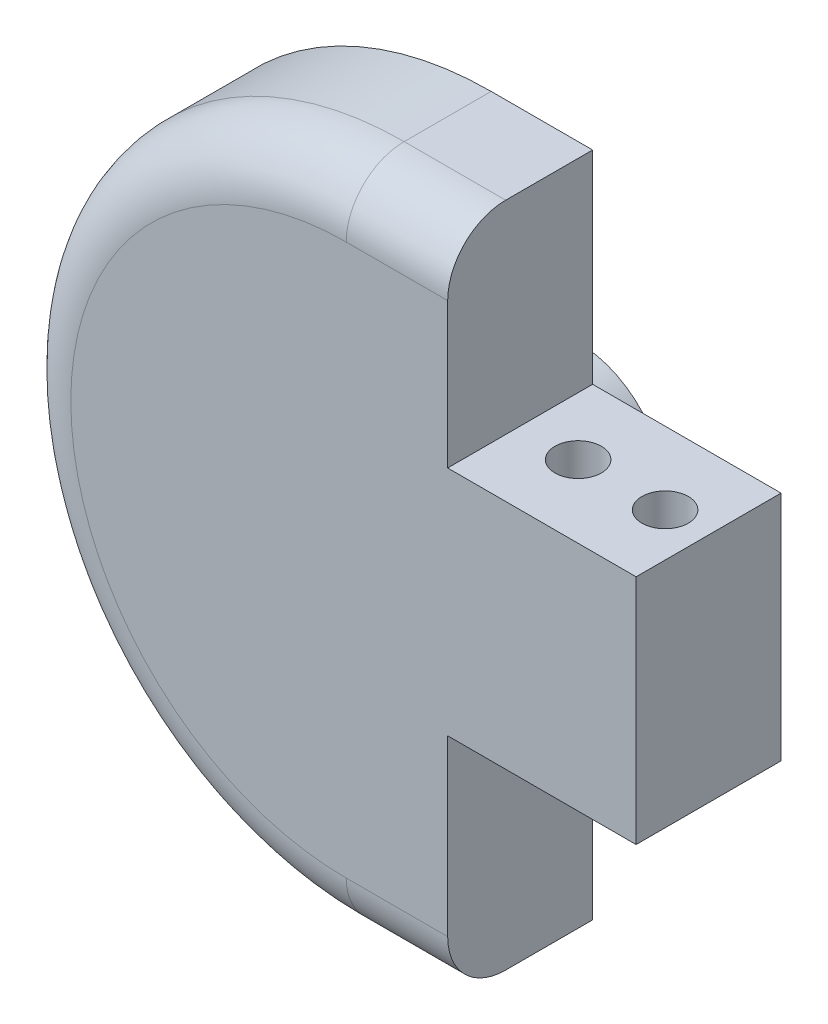
ISO-10303-21;
HEADER;
FILE_DESCRIPTION(('STEP AP214'),'2;1');
FILE_NAME('part.step','',(''),(''),'','','');
FILE_SCHEMA(('AUTOMOTIVE_DESIGN { 1 0 10303 214 1 1 1 1 }'));
ENDSEC;
DATA;
#1=APPLICATION_CONTEXT('core data for automotive mechanical design processes');
#2=APPLICATION_PROTOCOL_DEFINITION('international standard','automotive_design',2000,#1);
#3=PRODUCT_CONTEXT('',#1,'mechanical');
#4=PRODUCT('Part','Part','',(#3));
#5=PRODUCT_RELATED_PRODUCT_CATEGORY('part','',(#4));
#6=PRODUCT_DEFINITION_FORMATION('','',#4);
#7=PRODUCT_DEFINITION_CONTEXT('part definition',#1,'design');
#8=PRODUCT_DEFINITION('design','',#6,#7);
#9=PRODUCT_DEFINITION_SHAPE('','',#8);
#10=(LENGTH_UNIT() NAMED_UNIT(*) SI_UNIT(.MILLI.,.METRE.));
#11=(NAMED_UNIT(*) PLANE_ANGLE_UNIT() SI_UNIT($,.RADIAN.));
#12=(NAMED_UNIT(*) SI_UNIT($,.STERADIAN.) SOLID_ANGLE_UNIT());
#13=UNCERTAINTY_MEASURE_WITH_UNIT(LENGTH_MEASURE(1.E-05),#10,'distance_accuracy_value','');
#14=(GEOMETRIC_REPRESENTATION_CONTEXT(3) GLOBAL_UNCERTAINTY_ASSIGNED_CONTEXT((#13)) GLOBAL_UNIT_ASSIGNED_CONTEXT((#10,
#11,#12)) REPRESENTATION_CONTEXT('',''));
#15=CARTESIAN_POINT('',(0.,0.,0.));
#16=DIRECTION('',(0.,0.,1.));
#17=DIRECTION('',(1.,0.,0.));
#18=AXIS2_PLACEMENT_3D('',#15,#16,#17);
#19=CARTESIAN_POINT('',(0.,0.5,5.));
#20=DIRECTION('',(0.,0.,-1.));
#21=DIRECTION('',(-1.,0.,0.));
#22=AXIS2_PLACEMENT_3D('',#19,#20,#21);
#23=CYLINDRICAL_SURFACE('',#22,11.5);
#24=DIRECTION('',(0.,0.,-1.));
#25=VECTOR('',#24,1.);
#26=CARTESIAN_POINT('',(0.,-11.,5.));
#27=LINE('',#26,#25);
#28=CARTESIAN_POINT('',(0.,-11.,3.));
#29=VERTEX_POINT('',#28);
#30=CARTESIAN_POINT('',(0.,-11.,0.));
#31=VERTEX_POINT('',#30);
#32=EDGE_CURVE('E173',#29,#31,#27,.T.);
#33=ORIENTED_EDGE('',*,*,#32,.F.);
#34=CARTESIAN_POINT('',(0.,0.5,3.));
#35=DIRECTION('',(0.,0.,1.));
#36=DIRECTION('',(1.,0.,0.));
#37=AXIS2_PLACEMENT_3D('',#34,#35,#36);
#38=CIRCLE('',#37,11.5);
#39=CARTESIAN_POINT('',(0.,12.,3.));
#40=VERTEX_POINT('',#39);
#41=EDGE_CURVE('E11',#29,#40,#38,.F.);
#42=ORIENTED_EDGE('',*,*,#41,.T.);
#43=DIRECTION('',(0.,0.,-1.));
#44=VECTOR('',#43,1.);
#45=CARTESIAN_POINT('',(0.,12.,5.));
#46=LINE('',#45,#44);
#47=CARTESIAN_POINT('',(0.,12.,0.));
#48=VERTEX_POINT('',#47);
#49=EDGE_CURVE('E142',#40,#48,#46,.T.);
#50=ORIENTED_EDGE('',*,*,#49,.T.);
#51=CARTESIAN_POINT('',(0.,0.5,0.));
#52=DIRECTION('',(0.,0.,1.));
#53=DIRECTION('',(1.,0.,0.));
#54=AXIS2_PLACEMENT_3D('',#51,#52,#53);
#55=CIRCLE('',#54,11.5);
#56=EDGE_CURVE('E143',#48,#31,#55,.T.);
#57=ORIENTED_EDGE('',*,*,#56,.T.);
#58=EDGE_LOOP('',(#33,#42,#50,#57));
#59=FACE_BOUND('',#58,.T.);
#60=ADVANCED_FACE('F33',(#59),#23,.T.);
#61=CARTESIAN_POINT('',(0.,-11.,5.));
#62=DIRECTION('',(0.,1.,0.));
#63=DIRECTION('',(0.,0.,1.));
#64=AXIS2_PLACEMENT_3D('',#61,#62,#63);
#65=PLANE('',#64);
#66=DIRECTION('',(0.,0.,-1.));
#67=VECTOR('',#66,1.);
#68=CARTESIAN_POINT('',(3.5,-11.,5.));
#69=LINE('',#68,#67);
#70=CARTESIAN_POINT('',(3.5,-11.,3.));
#71=VERTEX_POINT('',#70);
#72=CARTESIAN_POINT('',(3.5,-11.,0.));
#73=VERTEX_POINT('',#72);
#74=EDGE_CURVE('E127',#71,#73,#69,.T.);
#75=ORIENTED_EDGE('',*,*,#74,.F.);
#76=DIRECTION('',(1.,0.,0.));
#77=VECTOR('',#76,1.);
#78=CARTESIAN_POINT('',(0.,-11.,3.));
#79=LINE('',#78,#77);
#80=EDGE_CURVE('E42',#71,#29,#79,.F.);
#81=ORIENTED_EDGE('',*,*,#80,.T.);
#82=ORIENTED_EDGE('',*,*,#32,.T.);
#83=DIRECTION('',(1.,0.,0.));
#84=VECTOR('',#83,1.);
#85=CARTESIAN_POINT('',(0.,-11.,0.));
#86=LINE('',#85,#84);
#87=EDGE_CURVE('E146',#31,#73,#86,.T.);
#88=ORIENTED_EDGE('',*,*,#87,.T.);
#89=EDGE_LOOP('',(#75,#81,#82,#88));
#90=FACE_BOUND('',#89,.T.);
#91=ADVANCED_FACE('F234',(#90),#65,.F.);
#92=CARTESIAN_POINT('',(3.5,-3.,5.));
#93=DIRECTION('',(-1.,0.,0.));
#94=DIRECTION('',(0.,0.,1.));
#95=AXIS2_PLACEMENT_3D('',#92,#93,#94);
#96=PLANE('',#95);
#97=DIRECTION('',(0.,1.,0.));
#98=VECTOR('',#97,1.);
#99=CARTESIAN_POINT('',(3.5,-3.,5.));
#100=LINE('',#99,#98);
#101=CARTESIAN_POINT('',(3.5,-9.,5.));
#102=VERTEX_POINT('',#101);
#103=CARTESIAN_POINT('',(3.5,-3.,5.));
#104=VERTEX_POINT('',#103);
#105=EDGE_CURVE('E109',#102,#104,#100,.T.);
#106=ORIENTED_EDGE('',*,*,#105,.F.);
#107=CARTESIAN_POINT('',(3.5,-9.,3.));
#108=DIRECTION('',(-1.,0.,0.));
#109=DIRECTION('',(0.,0.,1.));
#110=AXIS2_PLACEMENT_3D('',#107,#108,#109);
#111=CIRCLE('',#110,2.);
#112=EDGE_CURVE('E57',#102,#71,#111,.F.);
#113=ORIENTED_EDGE('',*,*,#112,.T.);
#114=ORIENTED_EDGE('',*,*,#74,.T.);
#115=DIRECTION('',(0.,1.,0.));
#116=VECTOR('',#115,1.);
#117=CARTESIAN_POINT('',(3.5,-3.,0.));
#118=LINE('',#117,#116);
#119=CARTESIAN_POINT('',(3.5,-3.,0.));
#120=VERTEX_POINT('',#119);
#121=EDGE_CURVE('E124',#73,#120,#118,.T.);
#122=ORIENTED_EDGE('',*,*,#121,.T.);
#123=DIRECTION('',(0.,0.,-1.));
#124=VECTOR('',#123,1.);
#125=CARTESIAN_POINT('',(3.5,-3.,5.));
#126=LINE('',#125,#124);
#127=EDGE_CURVE('E121',#104,#120,#126,.T.);
#128=ORIENTED_EDGE('',*,*,#127,.F.);
#129=EDGE_LOOP('',(#106,#113,#114,#122,#128));
#130=FACE_BOUND('',#129,.T.);
#131=ADVANCED_FACE('F122',(#130),#96,.F.);
#132=CARTESIAN_POINT('',(10.,-3.,5.));
#133=DIRECTION('',(0.,1.,0.));
#134=DIRECTION('',(0.,0.,1.));
#135=AXIS2_PLACEMENT_3D('',#132,#133,#134);
#136=PLANE('',#135);
#137=CARTESIAN_POINT('',(5.5,-3.,2.5));
#138=DIRECTION('',(0.,1.,0.));
#139=DIRECTION('',(0.,0.,1.));
#140=AXIS2_PLACEMENT_3D('',#137,#138,#139);
#141=CIRCLE('',#140,0.8);
#142=CARTESIAN_POINT('',(5.5,-3.,3.3));
#143=VERTEX_POINT('',#142);
#144=EDGE_CURVE('E179',#143,#143,#141,.T.);
#145=ORIENTED_EDGE('',*,*,#144,.T.);
#146=EDGE_LOOP('',(#145));
#147=FACE_BOUND('',#146,.T.);
#148=CARTESIAN_POINT('',(8.5,-3.,2.5));
#149=DIRECTION('',(0.,1.,0.));
#150=DIRECTION('',(0.,0.,1.));
#151=AXIS2_PLACEMENT_3D('',#148,#149,#150);
#152=CIRCLE('',#151,0.799999999999999);
#153=CARTESIAN_POINT('',(8.5,-3.,3.3));
#154=VERTEX_POINT('',#153);
#155=EDGE_CURVE('E147',#154,#154,#152,.T.);
#156=ORIENTED_EDGE('',*,*,#155,.T.);
#157=EDGE_LOOP('',(#156));
#158=FACE_BOUND('',#157,.T.);
#159=DIRECTION('',(1.,0.,0.));
#160=VECTOR('',#159,1.);
#161=CARTESIAN_POINT('',(10.,-3.,0.));
#162=LINE('',#161,#160);
#163=CARTESIAN_POINT('',(10.,-3.,0.));
#164=VERTEX_POINT('',#163);
#165=EDGE_CURVE('E151',#120,#164,#162,.T.);
#166=ORIENTED_EDGE('',*,*,#165,.T.);
#167=DIRECTION('',(0.,0.,-1.));
#168=VECTOR('',#167,1.);
#169=CARTESIAN_POINT('',(10.,-3.,5.));
#170=LINE('',#169,#168);
#171=CARTESIAN_POINT('',(10.,-3.,5.));
#172=VERTEX_POINT('',#171);
#173=EDGE_CURVE('E128',#172,#164,#170,.T.);
#174=ORIENTED_EDGE('',*,*,#173,.F.);
#175=DIRECTION('',(1.,0.,0.));
#176=VECTOR('',#175,1.);
#177=CARTESIAN_POINT('',(10.,-3.,5.));
#178=LINE('',#177,#176);
#179=EDGE_CURVE('E114',#104,#172,#178,.T.);
#180=ORIENTED_EDGE('',*,*,#179,.F.);
#181=ORIENTED_EDGE('',*,*,#127,.T.);
#182=EDGE_LOOP('',(#166,#174,#180,#181));
#183=FACE_BOUND('',#182,.T.);
#184=ADVANCED_FACE('F130',(#147,#158,#183),#136,.F.);
#185=CARTESIAN_POINT('',(10.,5.,5.));
#186=DIRECTION('',(-1.,0.,0.));
#187=DIRECTION('',(0.,0.,1.));
#188=AXIS2_PLACEMENT_3D('',#185,#186,#187);
#189=PLANE('',#188);
#190=DIRECTION('',(0.,1.,0.));
#191=VECTOR('',#190,1.);
#192=CARTESIAN_POINT('',(10.,5.,0.));
#193=LINE('',#192,#191);
#194=CARTESIAN_POINT('',(10.,5.,0.));
#195=VERTEX_POINT('',#194);
#196=EDGE_CURVE('E153',#164,#195,#193,.T.);
#197=ORIENTED_EDGE('',*,*,#196,.T.);
#198=DIRECTION('',(0.,0.,-1.));
#199=VECTOR('',#198,1.);
#200=CARTESIAN_POINT('',(10.,5.,5.));
#201=LINE('',#200,#199);
#202=CARTESIAN_POINT('',(10.,5.,5.));
#203=VERTEX_POINT('',#202);
#204=EDGE_CURVE('E168',#203,#195,#201,.T.);
#205=ORIENTED_EDGE('',*,*,#204,.F.);
#206=DIRECTION('',(0.,1.,0.));
#207=VECTOR('',#206,1.);
#208=CARTESIAN_POINT('',(10.,5.,5.));
#209=LINE('',#208,#207);
#210=EDGE_CURVE('E133',#172,#203,#209,.T.);
#211=ORIENTED_EDGE('',*,*,#210,.F.);
#212=ORIENTED_EDGE('',*,*,#173,.T.);
#213=EDGE_LOOP('',(#197,#205,#211,#212));
#214=FACE_BOUND('',#213,.T.);
#215=ADVANCED_FACE('F278',(#214),#189,.F.);
#216=CARTESIAN_POINT('',(3.5,5.,5.));
#217=DIRECTION('',(0.,-1.,0.));
#218=DIRECTION('',(0.,0.,-1.));
#219=AXIS2_PLACEMENT_3D('',#216,#217,#218);
#220=PLANE('',#219);
#221=CARTESIAN_POINT('',(5.5,5.,2.5));
#222=DIRECTION('',(0.,-1.,0.));
#223=DIRECTION('',(0.,0.,-1.));
#224=AXIS2_PLACEMENT_3D('',#221,#222,#223);
#225=CIRCLE('',#224,0.8);
#226=CARTESIAN_POINT('',(5.5,5.,1.7));
#227=VERTEX_POINT('',#226);
#228=EDGE_CURVE('E180',#227,#227,#225,.T.);
#229=ORIENTED_EDGE('',*,*,#228,.T.);
#230=EDGE_LOOP('',(#229));
#231=FACE_BOUND('',#230,.T.);
#232=CARTESIAN_POINT('',(8.5,5.,2.5));
#233=DIRECTION('',(0.,-1.,0.));
#234=DIRECTION('',(0.,0.,-1.));
#235=AXIS2_PLACEMENT_3D('',#232,#233,#234);
#236=CIRCLE('',#235,0.799999999999999);
#237=CARTESIAN_POINT('',(8.5,5.,1.7));
#238=VERTEX_POINT('',#237);
#239=EDGE_CURVE('E176',#238,#238,#236,.T.);
#240=ORIENTED_EDGE('',*,*,#239,.T.);
#241=EDGE_LOOP('',(#240));
#242=FACE_BOUND('',#241,.T.);
#243=DIRECTION('',(-1.,0.,0.));
#244=VECTOR('',#243,1.);
#245=CARTESIAN_POINT('',(3.5,5.,0.));
#246=LINE('',#245,#244);
#247=CARTESIAN_POINT('',(3.5,5.,0.));
#248=VERTEX_POINT('',#247);
#249=EDGE_CURVE('E155',#195,#248,#246,.T.);
#250=ORIENTED_EDGE('',*,*,#249,.T.);
#251=DIRECTION('',(0.,0.,-1.));
#252=VECTOR('',#251,1.);
#253=CARTESIAN_POINT('',(3.5,5.,5.));
#254=LINE('',#253,#252);
#255=CARTESIAN_POINT('',(3.5,5.,5.));
#256=VERTEX_POINT('',#255);
#257=EDGE_CURVE('E165',#256,#248,#254,.T.);
#258=ORIENTED_EDGE('',*,*,#257,.F.);
#259=DIRECTION('',(-1.,0.,0.));
#260=VECTOR('',#259,1.);
#261=CARTESIAN_POINT('',(3.5,5.,5.));
#262=LINE('',#261,#260);
#263=EDGE_CURVE('E135',#203,#256,#262,.T.);
#264=ORIENTED_EDGE('',*,*,#263,.F.);
#265=ORIENTED_EDGE('',*,*,#204,.T.);
#266=EDGE_LOOP('',(#250,#258,#264,#265));
#267=FACE_BOUND('',#266,.T.);
#268=ADVANCED_FACE('F271',(#231,#242,#267),#220,.F.);
#269=CARTESIAN_POINT('',(3.5,12.,5.));
#270=DIRECTION('',(-1.,0.,0.));
#271=DIRECTION('',(0.,0.,1.));
#272=AXIS2_PLACEMENT_3D('',#269,#270,#271);
#273=PLANE('',#272);
#274=DIRECTION('',(0.,0.,-1.));
#275=VECTOR('',#274,1.);
#276=CARTESIAN_POINT('',(3.5,12.,5.));
#277=LINE('',#276,#275);
#278=CARTESIAN_POINT('',(3.5,12.,3.));
#279=VERTEX_POINT('',#278);
#280=CARTESIAN_POINT('',(3.5,12.,0.));
#281=VERTEX_POINT('',#280);
#282=EDGE_CURVE('E163',#279,#281,#277,.T.);
#283=ORIENTED_EDGE('',*,*,#282,.F.);
#284=CARTESIAN_POINT('',(3.5,10.,3.));
#285=DIRECTION('',(-1.,0.,0.));
#286=DIRECTION('',(0.,0.,1.));
#287=AXIS2_PLACEMENT_3D('',#284,#285,#286);
#288=CIRCLE('',#287,2.);
#289=CARTESIAN_POINT('',(3.5,10.,5.));
#290=VERTEX_POINT('',#289);
#291=EDGE_CURVE('E191',#279,#290,#288,.F.);
#292=ORIENTED_EDGE('',*,*,#291,.T.);
#293=DIRECTION('',(0.,1.,0.));
#294=VECTOR('',#293,1.);
#295=CARTESIAN_POINT('',(3.5,12.,5.));
#296=LINE('',#295,#294);
#297=EDGE_CURVE('E140',#256,#290,#296,.T.);
#298=ORIENTED_EDGE('',*,*,#297,.F.);
#299=ORIENTED_EDGE('',*,*,#257,.T.);
#300=DIRECTION('',(0.,1.,0.));
#301=VECTOR('',#300,1.);
#302=CARTESIAN_POINT('',(3.5,12.,0.));
#303=LINE('',#302,#301);
#304=EDGE_CURVE('E157',#248,#281,#303,.T.);
#305=ORIENTED_EDGE('',*,*,#304,.T.);
#306=EDGE_LOOP('',(#283,#292,#298,#299,#305));
#307=FACE_BOUND('',#306,.T.);
#308=ADVANCED_FACE('F266',(#307),#273,.F.);
#309=CARTESIAN_POINT('',(0.,12.,5.));
#310=DIRECTION('',(0.,-1.,0.));
#311=DIRECTION('',(0.,0.,-1.));
#312=AXIS2_PLACEMENT_3D('',#309,#310,#311);
#313=PLANE('',#312);
#314=ORIENTED_EDGE('',*,*,#49,.F.);
#315=DIRECTION('',(-1.,0.,0.));
#316=VECTOR('',#315,1.);
#317=CARTESIAN_POINT('',(3.5,12.,3.));
#318=LINE('',#317,#316);
#319=EDGE_CURVE('E189',#40,#279,#318,.F.);
#320=ORIENTED_EDGE('',*,*,#319,.T.);
#321=ORIENTED_EDGE('',*,*,#282,.T.);
#322=DIRECTION('',(-1.,0.,0.));
#323=VECTOR('',#322,1.);
#324=CARTESIAN_POINT('',(0.,12.,0.));
#325=LINE('',#324,#323);
#326=EDGE_CURVE('E118',#281,#48,#325,.T.);
#327=ORIENTED_EDGE('',*,*,#326,.T.);
#328=EDGE_LOOP('',(#314,#320,#321,#327));
#329=FACE_BOUND('',#328,.T.);
#330=ADVANCED_FACE('F259',(#329),#313,.F.);
#331=CARTESIAN_POINT('',(0.,0.5,5.));
#332=DIRECTION('',(0.,0.,1.));
#333=DIRECTION('',(1.,0.,0.));
#334=AXIS2_PLACEMENT_3D('',#331,#332,#333);
#335=PLANE('',#334);
#336=ORIENTED_EDGE('',*,*,#297,.T.);
#337=DIRECTION('',(-1.,0.,0.));
#338=VECTOR('',#337,1.);
#339=CARTESIAN_POINT('',(0.,10.,5.));
#340=LINE('',#339,#338);
#341=CARTESIAN_POINT('',(0.,10.,5.));
#342=VERTEX_POINT('',#341);
#343=EDGE_CURVE('E186',#290,#342,#340,.T.);
#344=ORIENTED_EDGE('',*,*,#343,.T.);
#345=CARTESIAN_POINT('',(0.,0.5,5.));
#346=DIRECTION('',(0.,0.,1.));
#347=DIRECTION('',(1.,0.,0.));
#348=AXIS2_PLACEMENT_3D('',#345,#346,#347);
#349=CIRCLE('',#348,9.5);
#350=CARTESIAN_POINT('',(0.,-9.,5.));
#351=VERTEX_POINT('',#350);
#352=EDGE_CURVE('E175',#342,#351,#349,.T.);
#353=ORIENTED_EDGE('',*,*,#352,.T.);
#354=DIRECTION('',(1.,0.,0.));
#355=VECTOR('',#354,1.);
#356=CARTESIAN_POINT('',(3.5,-9.,5.));
#357=LINE('',#356,#355);
#358=EDGE_CURVE('E117',#351,#102,#357,.T.);
#359=ORIENTED_EDGE('',*,*,#358,.T.);
#360=ORIENTED_EDGE('',*,*,#105,.T.);
#361=ORIENTED_EDGE('',*,*,#179,.T.);
#362=ORIENTED_EDGE('',*,*,#210,.T.);
#363=ORIENTED_EDGE('',*,*,#263,.T.);
#364=EDGE_LOOP('',(#336,#344,#353,#359,#360,#361,#362,#363));
#365=FACE_BOUND('',#364,.T.);
#366=ADVANCED_FACE('F112',(#365),#335,.T.);
#367=CARTESIAN_POINT('',(0.,0.5,0.));
#368=DIRECTION('',(0.,0.,1.));
#369=DIRECTION('',(1.,0.,0.));
#370=AXIS2_PLACEMENT_3D('',#367,#368,#369);
#371=PLANE('',#370);
#372=CARTESIAN_POINT('',(0.,0.,0.));
#373=DIRECTION('',(0.,0.,1.));
#374=DIRECTION('',(1.,0.,0.));
#375=AXIS2_PLACEMENT_3D('',#372,#373,#374);
#376=CIRCLE('',#375,3.);
#377=CARTESIAN_POINT('',(3.,0.,0.));
#378=VERTEX_POINT('',#377);
#379=EDGE_CURVE('E201',#378,#378,#376,.T.);
#380=ORIENTED_EDGE('',*,*,#379,.T.);
#381=EDGE_LOOP('',(#380));
#382=FACE_BOUND('',#381,.T.);
#383=ORIENTED_EDGE('',*,*,#56,.F.);
#384=ORIENTED_EDGE('',*,*,#326,.F.);
#385=ORIENTED_EDGE('',*,*,#304,.F.);
#386=ORIENTED_EDGE('',*,*,#249,.F.);
#387=ORIENTED_EDGE('',*,*,#196,.F.);
#388=ORIENTED_EDGE('',*,*,#165,.F.);
#389=ORIENTED_EDGE('',*,*,#121,.F.);
#390=ORIENTED_EDGE('',*,*,#87,.F.);
#391=EDGE_LOOP('',(#383,#384,#385,#386,#387,#388,#389,#390));
#392=FACE_BOUND('',#391,.T.);
#393=ADVANCED_FACE('F220',(#382,#392),#371,.F.);
#394=CARTESIAN_POINT('',(8.5,-11.,2.5));
#395=DIRECTION('',(0.,1.,0.));
#396=DIRECTION('',(0.,0.,1.));
#397=AXIS2_PLACEMENT_3D('',#394,#395,#396);
#398=CYLINDRICAL_SURFACE('',#397,0.799999999999999);
#399=ORIENTED_EDGE('',*,*,#239,.F.);
#400=EDGE_LOOP('',(#399));
#401=FACE_BOUND('',#400,.T.);
#402=ORIENTED_EDGE('',*,*,#155,.F.);
#403=EDGE_LOOP('',(#402));
#404=FACE_BOUND('',#403,.T.);
#405=ADVANCED_FACE('F217',(#401,#404),#398,.F.);
#406=CARTESIAN_POINT('',(5.5,-11.,2.5));
#407=DIRECTION('',(0.,1.,0.));
#408=DIRECTION('',(0.,0.,1.));
#409=AXIS2_PLACEMENT_3D('',#406,#407,#408);
#410=CYLINDRICAL_SURFACE('',#409,0.8);
#411=ORIENTED_EDGE('',*,*,#228,.F.);
#412=EDGE_LOOP('',(#411));
#413=FACE_BOUND('',#412,.T.);
#414=ORIENTED_EDGE('',*,*,#144,.F.);
#415=EDGE_LOOP('',(#414));
#416=FACE_BOUND('',#415,.T.);
#417=ADVANCED_FACE('F219',(#413,#416),#410,.F.);
#418=CARTESIAN_POINT('',(0.,0.,-3.));
#419=DIRECTION('',(0.,0.,1.));
#420=DIRECTION('',(1.,0.,0.));
#421=AXIS2_PLACEMENT_3D('',#418,#419,#420);
#422=CYLINDRICAL_SURFACE('',#421,3.);
#423=CARTESIAN_POINT('',(0.,0.,-3.));
#424=DIRECTION('',(0.,0.,1.));
#425=DIRECTION('',(1.,0.,0.));
#426=AXIS2_PLACEMENT_3D('',#423,#424,#425);
#427=CIRCLE('',#426,3.);
#428=CARTESIAN_POINT('',(3.,0.,-3.));
#429=VERTEX_POINT('',#428);
#430=EDGE_CURVE('E183',#429,#429,#427,.T.);
#431=ORIENTED_EDGE('',*,*,#430,.T.);
#432=EDGE_LOOP('',(#431));
#433=FACE_BOUND('',#432,.T.);
#434=ORIENTED_EDGE('',*,*,#379,.F.);
#435=EDGE_LOOP('',(#434));
#436=FACE_BOUND('',#435,.T.);
#437=ADVANCED_FACE('F227',(#433,#436),#422,.T.);
#438=CARTESIAN_POINT('',(0.,0.,-3.));
#439=DIRECTION('',(0.,0.,1.));
#440=DIRECTION('',(1.,0.,0.));
#441=AXIS2_PLACEMENT_3D('',#438,#439,#440);
#442=PLANE('',#441);
#443=ORIENTED_EDGE('',*,*,#430,.F.);
#444=EDGE_LOOP('',(#443));
#445=FACE_BOUND('',#444,.T.);
#446=ADVANCED_FACE('F250',(#445),#442,.F.);
#447=CARTESIAN_POINT('',(0.,-9.,3.));
#448=DIRECTION('',(-1.,0.,0.));
#449=DIRECTION('',(0.,0.,1.));
#450=AXIS2_PLACEMENT_3D('',#447,#448,#449);
#451=CYLINDRICAL_SURFACE('',#450,2.);
#452=ORIENTED_EDGE('',*,*,#112,.F.);
#453=ORIENTED_EDGE('',*,*,#358,.F.);
#454=CARTESIAN_POINT('',(0.,-9.,3.));
#455=DIRECTION('',(-1.,0.,0.));
#456=DIRECTION('',(0.,0.,1.));
#457=AXIS2_PLACEMENT_3D('',#454,#455,#456);
#458=CIRCLE('',#457,2.);
#459=EDGE_CURVE('E37',#29,#351,#458,.T.);
#460=ORIENTED_EDGE('',*,*,#459,.F.);
#461=ORIENTED_EDGE('',*,*,#80,.F.);
#462=EDGE_LOOP('',(#452,#453,#460,#461));
#463=FACE_BOUND('',#462,.T.);
#464=ADVANCED_FACE('F35',(#463),#451,.T.);
#465=CARTESIAN_POINT('',(0.,0.5,3.));
#466=DIRECTION('',(0.,0.,1.));
#467=DIRECTION('',(1.,0.,0.));
#468=AXIS2_PLACEMENT_3D('',#465,#466,#467);
#469=TOROIDAL_SURFACE('',#468,9.5,2.);
#470=ORIENTED_EDGE('',*,*,#459,.T.);
#471=ORIENTED_EDGE('',*,*,#352,.F.);
#472=CARTESIAN_POINT('',(0.,10.,3.));
#473=DIRECTION('',(1.,0.,0.));
#474=DIRECTION('',(0.,0.,-1.));
#475=AXIS2_PLACEMENT_3D('',#472,#473,#474);
#476=CIRCLE('',#475,2.);
#477=EDGE_CURVE('E194',#40,#342,#476,.T.);
#478=ORIENTED_EDGE('',*,*,#477,.F.);
#479=ORIENTED_EDGE('',*,*,#41,.F.);
#480=EDGE_LOOP('',(#470,#471,#478,#479));
#481=FACE_BOUND('',#480,.T.);
#482=ADVANCED_FACE('F245',(#481),#469,.T.);
#483=CARTESIAN_POINT('',(0.,10.,3.));
#484=DIRECTION('',(1.,0.,0.));
#485=DIRECTION('',(0.,0.,-1.));
#486=AXIS2_PLACEMENT_3D('',#483,#484,#485);
#487=CYLINDRICAL_SURFACE('',#486,2.);
#488=ORIENTED_EDGE('',*,*,#291,.F.);
#489=ORIENTED_EDGE('',*,*,#319,.F.);
#490=ORIENTED_EDGE('',*,*,#477,.T.);
#491=ORIENTED_EDGE('',*,*,#343,.F.);
#492=EDGE_LOOP('',(#488,#489,#490,#491));
#493=FACE_BOUND('',#492,.T.);
#494=ADVANCED_FACE('F243',(#493),#487,.T.);
#495=CLOSED_SHELL('',(#60,#91,#131,#184,#215,#268,#308,#330,#366,#393,#405,#417,#437,#446,#464,
#482,#494));
#496=MANIFOLD_SOLID_BREP('B2',#495);
#497=ADVANCED_BREP_SHAPE_REPRESENTATION('',(#18,#496),#14);
#498=SHAPE_DEFINITION_REPRESENTATION(#9,#497);
ENDSEC;
END-ISO-10303-21;
